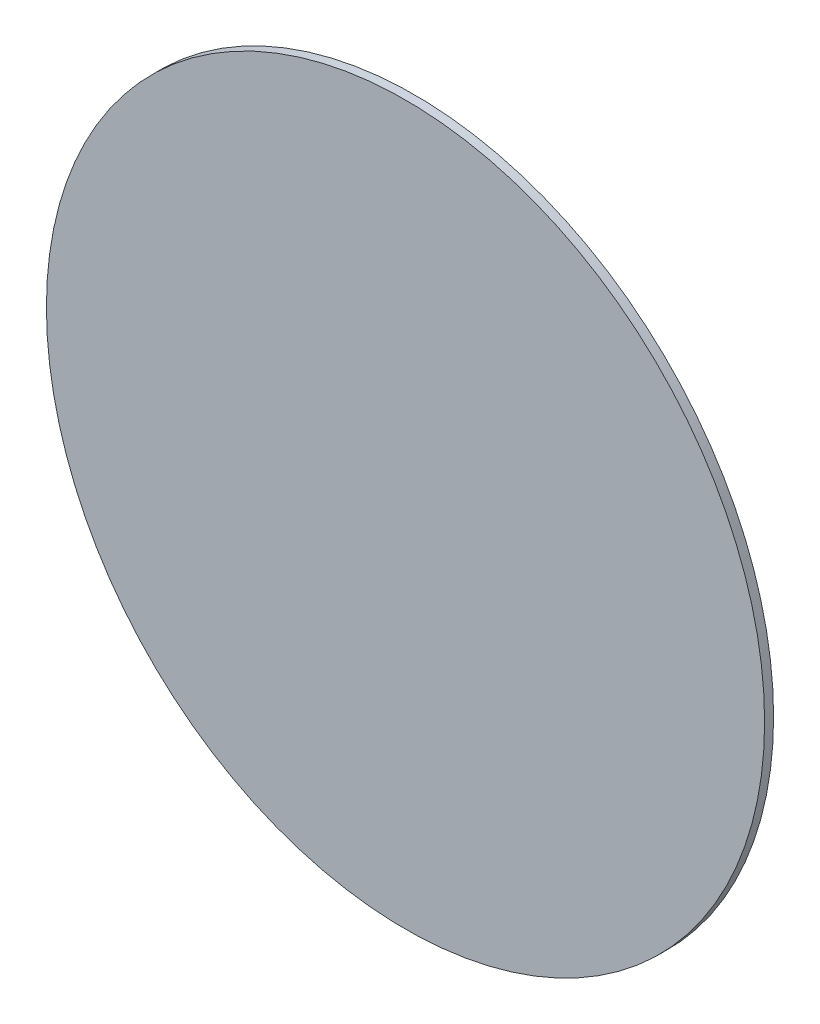
ISO-10303-21;
HEADER;
FILE_DESCRIPTION(('STEP AP214'),'2;1');
FILE_NAME('part.step','',(''),(''),'','','');
FILE_SCHEMA(('AUTOMOTIVE_DESIGN { 1 0 10303 214 1 1 1 1 }'));
ENDSEC;
DATA;
#1=APPLICATION_CONTEXT('core data for automotive mechanical design processes');
#2=APPLICATION_PROTOCOL_DEFINITION('international standard','automotive_design',2000,#1);
#3=PRODUCT_CONTEXT('',#1,'mechanical');
#4=PRODUCT('Part','Part','',(#3));
#5=PRODUCT_RELATED_PRODUCT_CATEGORY('part','',(#4));
#6=PRODUCT_DEFINITION_FORMATION('','',#4);
#7=PRODUCT_DEFINITION_CONTEXT('part definition',#1,'design');
#8=PRODUCT_DEFINITION('design','',#6,#7);
#9=PRODUCT_DEFINITION_SHAPE('','',#8);
#10=(LENGTH_UNIT() NAMED_UNIT(*) SI_UNIT(.MILLI.,.METRE.));
#11=(NAMED_UNIT(*) PLANE_ANGLE_UNIT() SI_UNIT($,.RADIAN.));
#12=(NAMED_UNIT(*) SI_UNIT($,.STERADIAN.) SOLID_ANGLE_UNIT());
#13=UNCERTAINTY_MEASURE_WITH_UNIT(LENGTH_MEASURE(1.E-05),#10,'distance_accuracy_value','');
#14=(GEOMETRIC_REPRESENTATION_CONTEXT(3) GLOBAL_UNCERTAINTY_ASSIGNED_CONTEXT((#13)) GLOBAL_UNIT_ASSIGNED_CONTEXT((#10,
#11,#12)) REPRESENTATION_CONTEXT('',''));
#15=CARTESIAN_POINT('',(0.,0.,0.));
#16=DIRECTION('',(0.,0.,1.));
#17=DIRECTION('',(1.,0.,0.));
#18=AXIS2_PLACEMENT_3D('',#15,#16,#17);
#19=CARTESIAN_POINT('',(0.,0.,0.5));
#20=DIRECTION('',(0.,0.,-1.));
#21=DIRECTION('',(-1.,0.,0.));
#22=AXIS2_PLACEMENT_3D('',#19,#20,#21);
#23=CYLINDRICAL_SURFACE('',#22,20.);
#24=CARTESIAN_POINT('',(0.,0.,0.5));
#25=DIRECTION('',(0.,0.,1.));
#26=DIRECTION('',(1.,0.,0.));
#27=AXIS2_PLACEMENT_3D('',#24,#25,#26);
#28=CIRCLE('',#27,20.);
#29=CARTESIAN_POINT('',(20.,0.,0.5));
#30=VERTEX_POINT('',#29);
#31=EDGE_CURVE('E10',#30,#30,#28,.T.);
#32=ORIENTED_EDGE('',*,*,#31,.F.);
#33=EDGE_LOOP('',(#32));
#34=FACE_BOUND('',#33,.T.);
#35=CARTESIAN_POINT('',(0.,0.,0.));
#36=DIRECTION('',(0.,0.,1.));
#37=DIRECTION('',(1.,0.,0.));
#38=AXIS2_PLACEMENT_3D('',#35,#36,#37);
#39=CIRCLE('',#38,20.);
#40=CARTESIAN_POINT('',(20.,0.,0.));
#41=VERTEX_POINT('',#40);
#42=EDGE_CURVE('E34',#41,#41,#39,.T.);
#43=ORIENTED_EDGE('',*,*,#42,.T.);
#44=EDGE_LOOP('',(#43));
#45=FACE_BOUND('',#44,.T.);
#46=ADVANCED_FACE('F31',(#34,#45),#23,.T.);
#47=CARTESIAN_POINT('',(0.,0.,0.5));
#48=DIRECTION('',(0.,0.,1.));
#49=DIRECTION('',(1.,0.,0.));
#50=AXIS2_PLACEMENT_3D('',#47,#48,#49);
#51=PLANE('',#50);
#52=ORIENTED_EDGE('',*,*,#31,.T.);
#53=EDGE_LOOP('',(#52));
#54=FACE_BOUND('',#53,.T.);
#55=ADVANCED_FACE('F46',(#54),#51,.T.);
#56=CARTESIAN_POINT('',(0.,0.,0.));
#57=DIRECTION('',(0.,0.,1.));
#58=DIRECTION('',(1.,0.,0.));
#59=AXIS2_PLACEMENT_3D('',#56,#57,#58);
#60=PLANE('',#59);
#61=ORIENTED_EDGE('',*,*,#42,.F.);
#62=EDGE_LOOP('',(#61));
#63=FACE_BOUND('',#62,.T.);
#64=ADVANCED_FACE('F44',(#63),#60,.F.);
#65=CLOSED_SHELL('',(#46,#55,#64));
#66=MANIFOLD_SOLID_BREP('B2',#65);
#67=ADVANCED_BREP_SHAPE_REPRESENTATION('',(#18,#66),#14);
#68=SHAPE_DEFINITION_REPRESENTATION(#9,#67);
ENDSEC;
END-ISO-10303-21;
